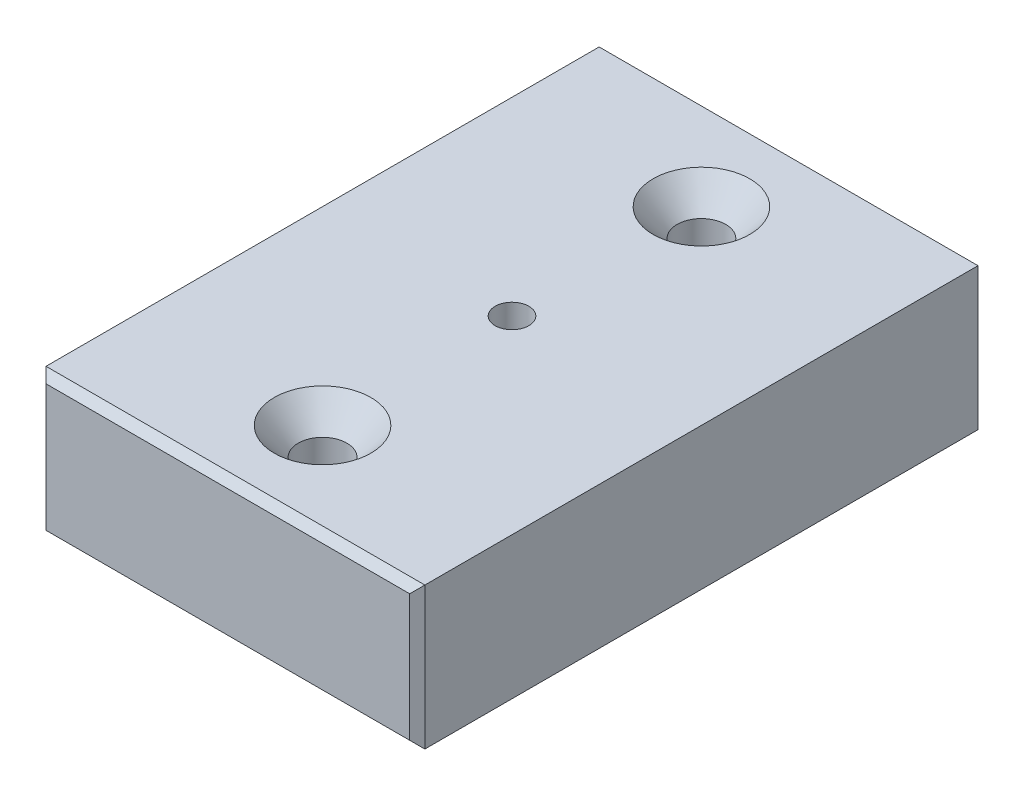
ISO-10303-21;
HEADER;
FILE_DESCRIPTION(('STEP AP214'),'2;1');
FILE_NAME('part.step','',(''),(''),'','','');
FILE_SCHEMA(('AUTOMOTIVE_DESIGN { 1 0 10303 214 1 1 1 1 }'));
ENDSEC;
DATA;
#1=APPLICATION_CONTEXT('core data for automotive mechanical design processes');
#2=APPLICATION_PROTOCOL_DEFINITION('international standard','automotive_design',2000,#1);
#3=PRODUCT_CONTEXT('',#1,'mechanical');
#4=PRODUCT('Part','Part','',(#3));
#5=PRODUCT_RELATED_PRODUCT_CATEGORY('part','',(#4));
#6=PRODUCT_DEFINITION_FORMATION('','',#4);
#7=PRODUCT_DEFINITION_CONTEXT('part definition',#1,'design');
#8=PRODUCT_DEFINITION('design','',#6,#7);
#9=PRODUCT_DEFINITION_SHAPE('','',#8);
#10=(LENGTH_UNIT() NAMED_UNIT(*) SI_UNIT(.MILLI.,.METRE.));
#11=(NAMED_UNIT(*) PLANE_ANGLE_UNIT() SI_UNIT($,.RADIAN.));
#12=(NAMED_UNIT(*) SI_UNIT($,.STERADIAN.) SOLID_ANGLE_UNIT());
#13=UNCERTAINTY_MEASURE_WITH_UNIT(LENGTH_MEASURE(1.E-05),#10,'distance_accuracy_value','');
#14=(GEOMETRIC_REPRESENTATION_CONTEXT(3) GLOBAL_UNCERTAINTY_ASSIGNED_CONTEXT((#13)) GLOBAL_UNIT_ASSIGNED_CONTEXT((#10,
#11,#12)) REPRESENTATION_CONTEXT('',''));
#15=CARTESIAN_POINT('',(0.,0.,0.));
#16=DIRECTION('',(0.,0.,1.));
#17=DIRECTION('',(1.,0.,0.));
#18=AXIS2_PLACEMENT_3D('',#15,#16,#17);
#19=CARTESIAN_POINT('',(12.7,4.7625,38.1));
#20=DIRECTION('',(0.,-1.,0.));
#21=DIRECTION('',(1.,0.,0.));
#22=AXIS2_PLACEMENT_3D('',#19,#20,#21);
#23=PLANE('',#22);
#24=CARTESIAN_POINT('',(0.,4.7625,6.34999999999999));
#25=DIRECTION('',(0.,1.,0.));
#26=DIRECTION('',(0.,0.,1.));
#27=AXIS2_PLACEMENT_3D('',#24,#25,#26);
#28=CIRCLE('',#27,3.2385);
#29=CARTESIAN_POINT('',(0.,4.7625,9.58849999999999));
#30=VERTEX_POINT('',#29);
#31=EDGE_CURVE('E350',#30,#30,#28,.T.);
#32=ORIENTED_EDGE('',*,*,#31,.F.);
#33=EDGE_LOOP('',(#32));
#34=FACE_BOUND('',#33,.T.);
#35=CARTESIAN_POINT('',(0.,4.76249999999999,31.75));
#36=DIRECTION('',(0.,1.,0.));
#37=DIRECTION('',(0.,0.,1.));
#38=AXIS2_PLACEMENT_3D('',#35,#36,#37);
#39=CIRCLE('',#38,3.2385);
#40=CARTESIAN_POINT('',(0.,4.76249999999999,34.9885));
#41=VERTEX_POINT('',#40);
#42=EDGE_CURVE('E312',#41,#41,#39,.T.);
#43=ORIENTED_EDGE('',*,*,#42,.F.);
#44=EDGE_LOOP('',(#43));
#45=FACE_BOUND('',#44,.T.);
#46=DIRECTION('',(0.,0.,-1.));
#47=VECTOR('',#46,1.);
#48=CARTESIAN_POINT('',(-12.7,4.76249999999999,38.1));
#49=LINE('',#48,#47);
#50=CARTESIAN_POINT('',(-12.7,4.76249999999999,37.592));
#51=VERTEX_POINT('',#50);
#52=CARTESIAN_POINT('',(-12.7,4.76249999999999,0.508000000000008));
#53=VERTEX_POINT('',#52);
#54=EDGE_CURVE('E324',#51,#53,#49,.T.);
#55=ORIENTED_EDGE('',*,*,#54,.F.);
#56=DIRECTION('',(1.,0.,0.));
#57=VECTOR('',#56,1.);
#58=CARTESIAN_POINT('',(12.7,4.7625,37.592));
#59=LINE('',#58,#57);
#60=CARTESIAN_POINT('',(12.7,4.7625,37.592));
#61=VERTEX_POINT('',#60);
#62=EDGE_CURVE('E112',#51,#61,#59,.T.);
#63=ORIENTED_EDGE('',*,*,#62,.T.);
#64=DIRECTION('',(0.,0.,-1.));
#65=VECTOR('',#64,1.);
#66=CARTESIAN_POINT('',(12.7,4.7625,38.1));
#67=LINE('',#66,#65);
#68=CARTESIAN_POINT('',(12.7,4.76249999999999,0.507999999999981));
#69=VERTEX_POINT('',#68);
#70=EDGE_CURVE('E327',#61,#69,#67,.T.);
#71=ORIENTED_EDGE('',*,*,#70,.T.);
#72=DIRECTION('',(-1.,0.,0.));
#73=VECTOR('',#72,1.);
#74=CARTESIAN_POINT('',(12.7,4.76249999999999,0.507999999999981));
#75=LINE('',#74,#73);
#76=EDGE_CURVE('E131',#69,#53,#75,.T.);
#77=ORIENTED_EDGE('',*,*,#76,.T.);
#78=EDGE_LOOP('',(#55,#63,#71,#77));
#79=FACE_BOUND('',#78,.T.);
#80=CARTESIAN_POINT('',(0.,4.7625,19.05));
#81=DIRECTION('',(0.,1.,0.));
#82=DIRECTION('',(0.,0.,1.));
#83=AXIS2_PLACEMENT_3D('',#80,#81,#82);
#84=CIRCLE('',#83,1.13029999999999);
#85=CARTESIAN_POINT('',(0.,4.7625,20.1803));
#86=VERTEX_POINT('',#85);
#87=EDGE_CURVE('E160',#86,#86,#84,.T.);
#88=ORIENTED_EDGE('',*,*,#87,.F.);
#89=EDGE_LOOP('',(#88));
#90=FACE_BOUND('',#89,.T.);
#91=ADVANCED_FACE('F40',(#34,#45,#79,#90),#23,.F.);
#92=CARTESIAN_POINT('',(-12.7,-4.7625,38.1));
#93=DIRECTION('',(1.,0.,0.));
#94=DIRECTION('',(0.,0.,-1.));
#95=AXIS2_PLACEMENT_3D('',#92,#93,#94);
#96=PLANE('',#95);
#97=DIRECTION('',(0.,0.,-1.));
#98=VECTOR('',#97,1.);
#99=CARTESIAN_POINT('',(-12.7,-4.7625,38.1));
#100=LINE('',#99,#98);
#101=CARTESIAN_POINT('',(-12.7,-4.7625,37.592));
#102=VERTEX_POINT('',#101);
#103=CARTESIAN_POINT('',(-12.7,-4.76250000000002,0.508000000000008));
#104=VERTEX_POINT('',#103);
#105=EDGE_CURVE('E125',#102,#104,#100,.T.);
#106=ORIENTED_EDGE('',*,*,#105,.F.);
#107=DIRECTION('',(0.,1.,0.));
#108=VECTOR('',#107,1.);
#109=CARTESIAN_POINT('',(-12.7,4.76249999999999,37.592));
#110=LINE('',#109,#108);
#111=EDGE_CURVE('E149',#102,#51,#110,.T.);
#112=ORIENTED_EDGE('',*,*,#111,.T.);
#113=ORIENTED_EDGE('',*,*,#54,.T.);
#114=DIRECTION('',(0.,-1.,0.));
#115=VECTOR('',#114,1.);
#116=CARTESIAN_POINT('',(-12.7,-4.76250000000002,0.507999999999981));
#117=LINE('',#116,#115);
#118=EDGE_CURVE('E147',#53,#104,#117,.T.);
#119=ORIENTED_EDGE('',*,*,#118,.T.);
#120=EDGE_LOOP('',(#106,#112,#113,#119));
#121=FACE_BOUND('',#120,.T.);
#122=ADVANCED_FACE('F197',(#121),#96,.F.);
#123=CARTESIAN_POINT('',(12.7,-4.7625,38.1));
#124=DIRECTION('',(0.,1.,0.));
#125=DIRECTION('',(-1.,0.,0.));
#126=AXIS2_PLACEMENT_3D('',#123,#124,#125);
#127=PLANE('',#126);
#128=CARTESIAN_POINT('',(0.,-4.7625,19.05));
#129=DIRECTION('',(0.,1.,0.));
#130=DIRECTION('',(-1.,0.,0.));
#131=AXIS2_PLACEMENT_3D('',#128,#129,#130);
#132=CIRCLE('',#131,1.13029999999999);
#133=CARTESIAN_POINT('',(-1.1303,-4.7625,19.05));
#134=VERTEX_POINT('',#133);
#135=EDGE_CURVE('E347',#134,#134,#132,.T.);
#136=ORIENTED_EDGE('',*,*,#135,.T.);
#137=EDGE_LOOP('',(#136));
#138=FACE_BOUND('',#137,.T.);
#139=CARTESIAN_POINT('',(0.,-4.7625,6.34999999999999));
#140=DIRECTION('',(0.,1.,0.));
#141=DIRECTION('',(-1.,0.,0.));
#142=AXIS2_PLACEMENT_3D('',#139,#140,#141);
#143=CIRCLE('',#142,1.63195);
#144=CARTESIAN_POINT('',(-1.63195000000001,-4.7625,6.34999999999999));
#145=VERTEX_POINT('',#144);
#146=EDGE_CURVE('E313',#145,#145,#143,.T.);
#147=ORIENTED_EDGE('',*,*,#146,.T.);
#148=EDGE_LOOP('',(#147));
#149=FACE_BOUND('',#148,.T.);
#150=CARTESIAN_POINT('',(0.,-4.76250000000002,31.75));
#151=DIRECTION('',(0.,1.,0.));
#152=DIRECTION('',(-1.,0.,0.));
#153=AXIS2_PLACEMENT_3D('',#150,#151,#152);
#154=CIRCLE('',#153,1.63195);
#155=CARTESIAN_POINT('',(-1.63195,-4.76250000000002,31.75));
#156=VERTEX_POINT('',#155);
#157=EDGE_CURVE('E315',#156,#156,#154,.T.);
#158=ORIENTED_EDGE('',*,*,#157,.T.);
#159=EDGE_LOOP('',(#158));
#160=FACE_BOUND('',#159,.T.);
#161=DIRECTION('',(0.,0.,-1.));
#162=VECTOR('',#161,1.);
#163=CARTESIAN_POINT('',(12.7,-4.7625,38.1));
#164=LINE('',#163,#162);
#165=CARTESIAN_POINT('',(12.7,-4.7625,37.592));
#166=VERTEX_POINT('',#165);
#167=CARTESIAN_POINT('',(12.7,-4.7625,0.507999999999981));
#168=VERTEX_POINT('',#167);
#169=EDGE_CURVE('E330',#166,#168,#164,.T.);
#170=ORIENTED_EDGE('',*,*,#169,.F.);
#171=DIRECTION('',(-1.,0.,0.));
#172=VECTOR('',#171,1.);
#173=CARTESIAN_POINT('',(-12.7,-4.7625,37.592));
#174=LINE('',#173,#172);
#175=EDGE_CURVE('E145',#166,#102,#174,.T.);
#176=ORIENTED_EDGE('',*,*,#175,.T.);
#177=ORIENTED_EDGE('',*,*,#105,.T.);
#178=DIRECTION('',(1.,0.,0.));
#179=VECTOR('',#178,1.);
#180=CARTESIAN_POINT('',(12.7,-4.7625,0.507999999999981));
#181=LINE('',#180,#179);
#182=EDGE_CURVE('E142',#104,#168,#181,.T.);
#183=ORIENTED_EDGE('',*,*,#182,.T.);
#184=EDGE_LOOP('',(#170,#176,#177,#183));
#185=FACE_BOUND('',#184,.T.);
#186=ADVANCED_FACE('F202',(#138,#149,#160,#185),#127,.F.);
#187=CARTESIAN_POINT('',(12.7,-4.7625,38.1));
#188=DIRECTION('',(-1.,0.,0.));
#189=DIRECTION('',(0.,0.,1.));
#190=AXIS2_PLACEMENT_3D('',#187,#188,#189);
#191=PLANE('',#190);
#192=ORIENTED_EDGE('',*,*,#70,.F.);
#193=DIRECTION('',(0.,-1.,0.));
#194=VECTOR('',#193,1.);
#195=CARTESIAN_POINT('',(12.7,-4.7625,37.592));
#196=LINE('',#195,#194);
#197=EDGE_CURVE('E140',#61,#166,#196,.T.);
#198=ORIENTED_EDGE('',*,*,#197,.T.);
#199=ORIENTED_EDGE('',*,*,#169,.T.);
#200=DIRECTION('',(0.,1.,0.));
#201=VECTOR('',#200,1.);
#202=CARTESIAN_POINT('',(12.7,-4.7625,0.507999999999981));
#203=LINE('',#202,#201);
#204=EDGE_CURVE('E138',#168,#69,#203,.T.);
#205=ORIENTED_EDGE('',*,*,#204,.T.);
#206=EDGE_LOOP('',(#192,#198,#199,#205));
#207=FACE_BOUND('',#206,.T.);
#208=ADVANCED_FACE('F193',(#207),#191,.F.);
#209=CARTESIAN_POINT('',(0.,0.,38.1));
#210=DIRECTION('',(0.,0.,1.));
#211=DIRECTION('',(1.,0.,0.));
#212=AXIS2_PLACEMENT_3D('',#209,#210,#211);
#213=PLANE('',#212);
#214=DIRECTION('',(0.,1.,0.));
#215=VECTOR('',#214,1.);
#216=CARTESIAN_POINT('',(12.192,4.7625,38.1));
#217=LINE('',#216,#215);
#218=CARTESIAN_POINT('',(12.192,-4.25449999999999,38.1));
#219=VERTEX_POINT('',#218);
#220=CARTESIAN_POINT('',(12.192,4.25449999999999,38.1));
#221=VERTEX_POINT('',#220);
#222=EDGE_CURVE('E129',#219,#221,#217,.T.);
#223=ORIENTED_EDGE('',*,*,#222,.T.);
#224=DIRECTION('',(-1.,0.,0.));
#225=VECTOR('',#224,1.);
#226=CARTESIAN_POINT('',(-12.7,4.25449999999999,38.1));
#227=LINE('',#226,#225);
#228=CARTESIAN_POINT('',(-12.192,4.25449999999999,38.1));
#229=VERTEX_POINT('',#228);
#230=EDGE_CURVE('E110',#221,#229,#227,.T.);
#231=ORIENTED_EDGE('',*,*,#230,.T.);
#232=DIRECTION('',(0.,-1.,0.));
#233=VECTOR('',#232,1.);
#234=CARTESIAN_POINT('',(-12.192,-4.7625,38.1));
#235=LINE('',#234,#233);
#236=CARTESIAN_POINT('',(-12.192,-4.25450000000001,38.1));
#237=VERTEX_POINT('',#236);
#238=EDGE_CURVE('E118',#229,#237,#235,.T.);
#239=ORIENTED_EDGE('',*,*,#238,.T.);
#240=DIRECTION('',(1.,0.,0.));
#241=VECTOR('',#240,1.);
#242=CARTESIAN_POINT('',(12.7,-4.25449999999999,38.1));
#243=LINE('',#242,#241);
#244=EDGE_CURVE('E124',#237,#219,#243,.T.);
#245=ORIENTED_EDGE('',*,*,#244,.T.);
#246=EDGE_LOOP('',(#223,#231,#239,#245));
#247=FACE_BOUND('',#246,.T.);
#248=ADVANCED_FACE('F127',(#247),#213,.T.);
#249=CARTESIAN_POINT('',(0.,0.,0.));
#250=DIRECTION('',(0.,0.,1.));
#251=DIRECTION('',(1.,0.,0.));
#252=AXIS2_PLACEMENT_3D('',#249,#250,#251);
#253=PLANE('',#252);
#254=DIRECTION('',(0.,-1.,0.));
#255=VECTOR('',#254,1.);
#256=CARTESIAN_POINT('',(12.192,0.,0.));
#257=LINE('',#256,#255);
#258=CARTESIAN_POINT('',(12.192,4.25449999999999,0.));
#259=VERTEX_POINT('',#258);
#260=CARTESIAN_POINT('',(12.192,-4.25450000000001,0.));
#261=VERTEX_POINT('',#260);
#262=EDGE_CURVE('E49',#259,#261,#257,.T.);
#263=ORIENTED_EDGE('',*,*,#262,.T.);
#264=DIRECTION('',(-1.,0.,0.));
#265=VECTOR('',#264,1.);
#266=CARTESIAN_POINT('',(0.,-4.25449999999999,0.));
#267=LINE('',#266,#265);
#268=CARTESIAN_POINT('',(-12.192,-4.25450000000001,0.));
#269=VERTEX_POINT('',#268);
#270=EDGE_CURVE('E11',#261,#269,#267,.T.);
#271=ORIENTED_EDGE('',*,*,#270,.T.);
#272=DIRECTION('',(0.,1.,0.));
#273=VECTOR('',#272,1.);
#274=CARTESIAN_POINT('',(-12.192,0.,0.));
#275=LINE('',#274,#273);
#276=CARTESIAN_POINT('',(-12.192,4.25449999999999,0.));
#277=VERTEX_POINT('',#276);
#278=EDGE_CURVE('E151',#269,#277,#275,.T.);
#279=ORIENTED_EDGE('',*,*,#278,.T.);
#280=DIRECTION('',(1.,0.,0.));
#281=VECTOR('',#280,1.);
#282=CARTESIAN_POINT('',(0.,4.25449999999999,0.));
#283=LINE('',#282,#281);
#284=EDGE_CURVE('E60',#277,#259,#283,.T.);
#285=ORIENTED_EDGE('',*,*,#284,.T.);
#286=EDGE_LOOP('',(#263,#271,#279,#285));
#287=FACE_BOUND('',#286,.T.);
#288=ADVANCED_FACE('F182',(#287),#253,.F.);
#289=CARTESIAN_POINT('',(0.,4.76249999999999,31.75));
#290=DIRECTION('',(0.,1.,0.));
#291=DIRECTION('',(0.,0.,1.));
#292=AXIS2_PLACEMENT_3D('',#289,#290,#291);
#293=CYLINDRICAL_SURFACE('',#292,1.63195);
#294=ORIENTED_EDGE('',*,*,#157,.F.);
#295=EDGE_LOOP('',(#294));
#296=FACE_BOUND('',#295,.T.);
#297=CARTESIAN_POINT('',(0.,2.91437563537908,31.75));
#298=DIRECTION('',(0.,1.,0.));
#299=DIRECTION('',(0.,0.,1.));
#300=AXIS2_PLACEMENT_3D('',#297,#298,#299);
#301=CIRCLE('',#300,1.63195);
#302=CARTESIAN_POINT('',(0.,2.91437563537908,33.38195));
#303=VERTEX_POINT('',#302);
#304=EDGE_CURVE('E309',#303,#303,#301,.T.);
#305=ORIENTED_EDGE('',*,*,#304,.T.);
#306=EDGE_LOOP('',(#305));
#307=FACE_BOUND('',#306,.T.);
#308=ADVANCED_FACE('F184',(#296,#307),#293,.F.);
#309=CARTESIAN_POINT('',(0.,4.76249999999999,31.75));
#310=DIRECTION('',(0.,1.,0.));
#311=DIRECTION('',(0.,0.,1.));
#312=AXIS2_PLACEMENT_3D('',#309,#310,#311);
#313=CONICAL_SURFACE('',#312,3.2385,0.715584993317675);
#314=ORIENTED_EDGE('',*,*,#304,.F.);
#315=EDGE_LOOP('',(#314));
#316=FACE_BOUND('',#315,.T.);
#317=ORIENTED_EDGE('',*,*,#42,.T.);
#318=EDGE_LOOP('',(#317));
#319=FACE_BOUND('',#318,.T.);
#320=ADVANCED_FACE('F190',(#316,#319),#313,.F.);
#321=CARTESIAN_POINT('',(0.,4.7625,6.34999999999999));
#322=DIRECTION('',(0.,1.,0.));
#323=DIRECTION('',(0.,0.,1.));
#324=AXIS2_PLACEMENT_3D('',#321,#322,#323);
#325=CYLINDRICAL_SURFACE('',#324,1.63195);
#326=ORIENTED_EDGE('',*,*,#146,.F.);
#327=EDGE_LOOP('',(#326));
#328=FACE_BOUND('',#327,.T.);
#329=CARTESIAN_POINT('',(0.,2.91437563537908,6.34999999999999));
#330=DIRECTION('',(0.,1.,0.));
#331=DIRECTION('',(0.,0.,1.));
#332=AXIS2_PLACEMENT_3D('',#329,#330,#331);
#333=CIRCLE('',#332,1.63195);
#334=CARTESIAN_POINT('',(0.,2.91437563537908,7.98194999999999));
#335=VERTEX_POINT('',#334);
#336=EDGE_CURVE('E318',#335,#335,#333,.T.);
#337=ORIENTED_EDGE('',*,*,#336,.T.);
#338=EDGE_LOOP('',(#337));
#339=FACE_BOUND('',#338,.T.);
#340=ADVANCED_FACE('F266',(#328,#339),#325,.F.);
#341=CARTESIAN_POINT('',(0.,4.7625,6.34999999999999));
#342=DIRECTION('',(0.,1.,0.));
#343=DIRECTION('',(0.,0.,1.));
#344=AXIS2_PLACEMENT_3D('',#341,#342,#343);
#345=CONICAL_SURFACE('',#344,3.2385,0.715584993317675);
#346=ORIENTED_EDGE('',*,*,#336,.F.);
#347=EDGE_LOOP('',(#346));
#348=FACE_BOUND('',#347,.T.);
#349=ORIENTED_EDGE('',*,*,#31,.T.);
#350=EDGE_LOOP('',(#349));
#351=FACE_BOUND('',#350,.T.);
#352=ADVANCED_FACE('F259',(#348,#351),#345,.F.);
#353=CARTESIAN_POINT('',(0.,4.7625,19.05));
#354=DIRECTION('',(0.,1.,0.));
#355=DIRECTION('',(0.,0.,1.));
#356=AXIS2_PLACEMENT_3D('',#353,#354,#355);
#357=CYLINDRICAL_SURFACE('',#356,1.13029999999999);
#358=ORIENTED_EDGE('',*,*,#135,.F.);
#359=EDGE_LOOP('',(#358));
#360=FACE_BOUND('',#359,.T.);
#361=ORIENTED_EDGE('',*,*,#87,.T.);
#362=EDGE_LOOP('',(#361));
#363=FACE_BOUND('',#362,.T.);
#364=ADVANCED_FACE('F225',(#360,#363),#357,.F.);
#365=CARTESIAN_POINT('',(0.,-4.25450000000001,38.1));
#366=DIRECTION('',(0.,-0.707106781186547,0.707106781186547));
#367=DIRECTION('',(-1.,0.,0.));
#368=AXIS2_PLACEMENT_3D('',#365,#366,#367);
#369=PLANE('',#368);
#370=DIRECTION('',(0.577350269189626,0.577350269189626,0.577350269189626));
#371=VECTOR('',#370,1.);
#372=CARTESIAN_POINT('',(-10.7738333333333,-2.83633333333334,39.5181666666667));
#373=LINE('',#372,#371);
#374=EDGE_CURVE('E121',#102,#237,#373,.T.);
#375=ORIENTED_EDGE('',*,*,#374,.F.);
#376=ORIENTED_EDGE('',*,*,#175,.F.);
#377=DIRECTION('',(-0.577350269189626,0.577350269189626,0.577350269189626));
#378=VECTOR('',#377,1.);
#379=CARTESIAN_POINT('',(8.128,-0.190499999999996,42.164));
#380=LINE('',#379,#378);
#381=EDGE_CURVE('E157',#219,#166,#380,.F.);
#382=ORIENTED_EDGE('',*,*,#381,.F.);
#383=ORIENTED_EDGE('',*,*,#244,.F.);
#384=EDGE_LOOP('',(#375,#376,#382,#383));
#385=FACE_BOUND('',#384,.T.);
#386=ADVANCED_FACE('F221',(#385),#369,.T.);
#387=CARTESIAN_POINT('',(12.192,0.,38.1));
#388=DIRECTION('',(0.707106781186547,0.,0.707106781186547));
#389=DIRECTION('',(0.,-1.,0.));
#390=AXIS2_PLACEMENT_3D('',#387,#388,#389);
#391=PLANE('',#390);
#392=ORIENTED_EDGE('',*,*,#381,.T.);
#393=ORIENTED_EDGE('',*,*,#197,.F.);
#394=DIRECTION('',(-0.577350269189626,-0.577350269189626,0.577350269189626));
#395=VECTOR('',#394,1.);
#396=CARTESIAN_POINT('',(10.7738333333333,2.83633333333333,39.5181666666667));
#397=LINE('',#396,#395);
#398=EDGE_CURVE('E115',#221,#61,#397,.F.);
#399=ORIENTED_EDGE('',*,*,#398,.F.);
#400=ORIENTED_EDGE('',*,*,#222,.F.);
#401=EDGE_LOOP('',(#392,#393,#399,#400));
#402=FACE_BOUND('',#401,.T.);
#403=ADVANCED_FACE('F218',(#402),#391,.T.);
#404=CARTESIAN_POINT('',(-12.192,0.,38.1));
#405=DIRECTION('',(-0.707106781186547,0.,0.707106781186547));
#406=DIRECTION('',(0.,1.,0.));
#407=AXIS2_PLACEMENT_3D('',#404,#405,#406);
#408=PLANE('',#407);
#409=ORIENTED_EDGE('',*,*,#374,.T.);
#410=ORIENTED_EDGE('',*,*,#238,.F.);
#411=DIRECTION('',(-0.577350269189626,0.577350269189626,-0.577350269189626));
#412=VECTOR('',#411,1.);
#413=CARTESIAN_POINT('',(-10.7738333333333,2.83633333333333,39.5181666666667));
#414=LINE('',#413,#412);
#415=EDGE_CURVE('E106',#51,#229,#414,.F.);
#416=ORIENTED_EDGE('',*,*,#415,.F.);
#417=ORIENTED_EDGE('',*,*,#111,.F.);
#418=EDGE_LOOP('',(#409,#410,#416,#417));
#419=FACE_BOUND('',#418,.T.);
#420=ADVANCED_FACE('F119',(#419),#408,.T.);
#421=CARTESIAN_POINT('',(0.,4.25449999999998,38.1));
#422=DIRECTION('',(0.,0.707106781186547,0.707106781186547));
#423=DIRECTION('',(1.,0.,0.));
#424=AXIS2_PLACEMENT_3D('',#421,#422,#423);
#425=PLANE('',#424);
#426=ORIENTED_EDGE('',*,*,#398,.T.);
#427=ORIENTED_EDGE('',*,*,#62,.F.);
#428=ORIENTED_EDGE('',*,*,#415,.T.);
#429=ORIENTED_EDGE('',*,*,#230,.F.);
#430=EDGE_LOOP('',(#426,#427,#428,#429));
#431=FACE_BOUND('',#430,.T.);
#432=ADVANCED_FACE('F108',(#431),#425,.T.);
#433=CARTESIAN_POINT('',(12.7,4.76249999999999,0.507999999999981));
#434=DIRECTION('',(0.,-0.707106781186543,0.707106781186552));
#435=DIRECTION('',(-1.,0.,0.));
#436=AXIS2_PLACEMENT_3D('',#433,#434,#435);
#437=PLANE('',#436);
#438=DIRECTION('',(-0.577350269189628,-0.577350269189629,-0.57735026918962));
#439=VECTOR('',#438,1.);
#440=CARTESIAN_POINT('',(12.7,4.76249999999999,0.507999999999981));
#441=LINE('',#440,#439);
#442=EDGE_CURVE('E164',#259,#69,#441,.F.);
#443=ORIENTED_EDGE('',*,*,#442,.F.);
#444=ORIENTED_EDGE('',*,*,#284,.F.);
#445=DIRECTION('',(0.577350269189628,-0.577350269189628,-0.577350269189621));
#446=VECTOR('',#445,1.);
#447=CARTESIAN_POINT('',(-9.52499999999997,1.58749999999996,-2.667));
#448=LINE('',#447,#446);
#449=EDGE_CURVE('E44',#53,#277,#448,.T.);
#450=ORIENTED_EDGE('',*,*,#449,.F.);
#451=ORIENTED_EDGE('',*,*,#76,.F.);
#452=EDGE_LOOP('',(#443,#444,#450,#451));
#453=FACE_BOUND('',#452,.T.);
#454=ADVANCED_FACE('F42',(#453),#437,.F.);
#455=CARTESIAN_POINT('',(-12.7,-4.76250000000002,0.507999999999981));
#456=DIRECTION('',(0.707106781186543,0.,0.707106781186552));
#457=DIRECTION('',(0.,-1.,0.));
#458=AXIS2_PLACEMENT_3D('',#455,#456,#457);
#459=PLANE('',#458);
#460=ORIENTED_EDGE('',*,*,#449,.T.);
#461=ORIENTED_EDGE('',*,*,#278,.F.);
#462=DIRECTION('',(-0.577350269189628,-0.577350269189628,0.577350269189621));
#463=VECTOR('',#462,1.);
#464=CARTESIAN_POINT('',(-12.7,-4.76250000000002,0.507999999999981));
#465=LINE('',#464,#463);
#466=EDGE_CURVE('E163',#104,#269,#465,.F.);
#467=ORIENTED_EDGE('',*,*,#466,.F.);
#468=ORIENTED_EDGE('',*,*,#118,.F.);
#469=EDGE_LOOP('',(#460,#461,#467,#468));
#470=FACE_BOUND('',#469,.T.);
#471=ADVANCED_FACE('F173',(#470),#459,.F.);
#472=CARTESIAN_POINT('',(12.7,-4.7625,0.507999999999981));
#473=DIRECTION('',(-0.707106781186543,0.,0.707106781186552));
#474=DIRECTION('',(0.,1.,0.));
#475=AXIS2_PLACEMENT_3D('',#472,#473,#474);
#476=PLANE('',#475);
#477=ORIENTED_EDGE('',*,*,#442,.T.);
#478=ORIENTED_EDGE('',*,*,#204,.F.);
#479=DIRECTION('',(-0.577350269189628,0.577350269189628,-0.577350269189621));
#480=VECTOR('',#479,1.);
#481=CARTESIAN_POINT('',(12.7,-4.7625,0.507999999999981));
#482=LINE('',#481,#480);
#483=EDGE_CURVE('E161',#261,#168,#482,.F.);
#484=ORIENTED_EDGE('',*,*,#483,.F.);
#485=ORIENTED_EDGE('',*,*,#262,.F.);
#486=EDGE_LOOP('',(#477,#478,#484,#485));
#487=FACE_BOUND('',#486,.T.);
#488=ADVANCED_FACE('F178',(#487),#476,.F.);
#489=CARTESIAN_POINT('',(12.7,-4.7625,0.507999999999981));
#490=DIRECTION('',(0.,0.707106781186543,0.707106781186552));
#491=DIRECTION('',(1.,0.,0.));
#492=AXIS2_PLACEMENT_3D('',#489,#490,#491);
#493=PLANE('',#492);
#494=ORIENTED_EDGE('',*,*,#466,.T.);
#495=ORIENTED_EDGE('',*,*,#270,.F.);
#496=ORIENTED_EDGE('',*,*,#483,.T.);
#497=ORIENTED_EDGE('',*,*,#182,.F.);
#498=EDGE_LOOP('',(#494,#495,#496,#497));
#499=FACE_BOUND('',#498,.T.);
#500=ADVANCED_FACE('F181',(#499),#493,.F.);
#501=CLOSED_SHELL('',(#91,#122,#186,#208,#248,#288,#308,#320,#340,#352,#364,#386,#403,#420,#432,
#454,#471,#488,#500));
#502=MANIFOLD_SOLID_BREP('B2',#501);
#503=ADVANCED_BREP_SHAPE_REPRESENTATION('',(#18,#502),#14);
#504=SHAPE_DEFINITION_REPRESENTATION(#9,#503);
ENDSEC;
END-ISO-10303-21;
